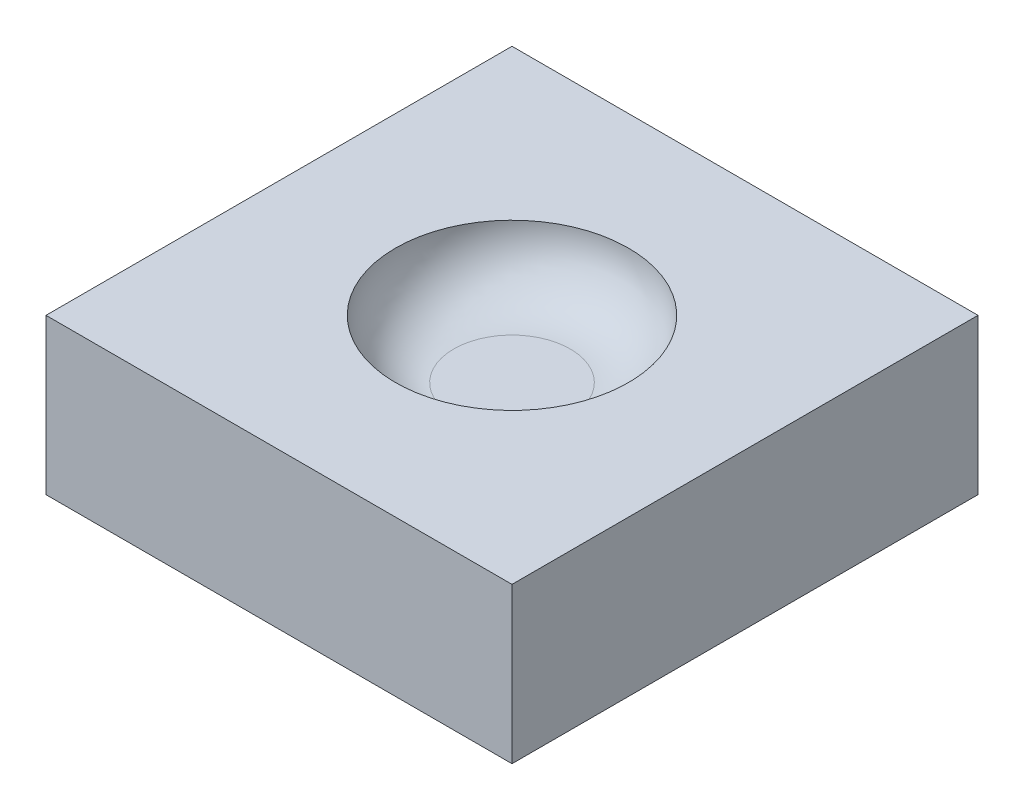
ISO-10303-21;
HEADER;
FILE_DESCRIPTION(('STEP AP214'),'2;1');
FILE_NAME('part.step','',(''),(''),'','','');
FILE_SCHEMA(('AUTOMOTIVE_DESIGN { 1 0 10303 214 1 1 1 1 }'));
ENDSEC;
DATA;
#1=APPLICATION_CONTEXT('core data for automotive mechanical design processes');
#2=APPLICATION_PROTOCOL_DEFINITION('international standard','automotive_design',2000,#1);
#3=PRODUCT_CONTEXT('',#1,'mechanical');
#4=PRODUCT('Part','Part','',(#3));
#5=PRODUCT_RELATED_PRODUCT_CATEGORY('part','',(#4));
#6=PRODUCT_DEFINITION_FORMATION('','',#4);
#7=PRODUCT_DEFINITION_CONTEXT('part definition',#1,'design');
#8=PRODUCT_DEFINITION('design','',#6,#7);
#9=PRODUCT_DEFINITION_SHAPE('','',#8);
#10=(LENGTH_UNIT() NAMED_UNIT(*) SI_UNIT(.MILLI.,.METRE.));
#11=(NAMED_UNIT(*) PLANE_ANGLE_UNIT() SI_UNIT($,.RADIAN.));
#12=(NAMED_UNIT(*) SI_UNIT($,.STERADIAN.) SOLID_ANGLE_UNIT());
#13=UNCERTAINTY_MEASURE_WITH_UNIT(LENGTH_MEASURE(1.E-05),#10,'distance_accuracy_value','');
#14=(GEOMETRIC_REPRESENTATION_CONTEXT(3) GLOBAL_UNCERTAINTY_ASSIGNED_CONTEXT((#13)) GLOBAL_UNIT_ASSIGNED_CONTEXT((#10,
#11,#12)) REPRESENTATION_CONTEXT('',''));
#15=CARTESIAN_POINT('',(0.,0.,0.));
#16=DIRECTION('',(0.,0.,1.));
#17=DIRECTION('',(1.,0.,0.));
#18=AXIS2_PLACEMENT_3D('',#15,#16,#17);
#19=CARTESIAN_POINT('',(76.2,50.8,76.2));
#20=DIRECTION('',(-1.,0.,0.));
#21=DIRECTION('',(0.,0.,1.));
#22=AXIS2_PLACEMENT_3D('',#19,#20,#21);
#23=PLANE('',#22);
#24=DIRECTION('',(0.,0.,-1.));
#25=VECTOR('',#24,1.);
#26=CARTESIAN_POINT('',(76.2,0.,76.2));
#27=LINE('',#26,#25);
#28=CARTESIAN_POINT('',(76.2,0.,76.2));
#29=VERTEX_POINT('',#28);
#30=CARTESIAN_POINT('',(76.2,0.,-76.2));
#31=VERTEX_POINT('',#30);
#32=EDGE_CURVE('E111',#29,#31,#27,.T.);
#33=ORIENTED_EDGE('',*,*,#32,.T.);
#34=DIRECTION('',(0.,-1.,0.));
#35=VECTOR('',#34,1.);
#36=CARTESIAN_POINT('',(76.2,50.8,-76.2));
#37=LINE('',#36,#35);
#38=CARTESIAN_POINT('',(76.2,50.8,-76.2));
#39=VERTEX_POINT('',#38);
#40=EDGE_CURVE('E11',#39,#31,#37,.T.);
#41=ORIENTED_EDGE('',*,*,#40,.F.);
#42=DIRECTION('',(0.,0.,-1.));
#43=VECTOR('',#42,1.);
#44=CARTESIAN_POINT('',(76.2,50.8,76.2));
#45=LINE('',#44,#43);
#46=CARTESIAN_POINT('',(76.2,50.8,76.2));
#47=VERTEX_POINT('',#46);
#48=EDGE_CURVE('E95',#47,#39,#45,.T.);
#49=ORIENTED_EDGE('',*,*,#48,.F.);
#50=DIRECTION('',(0.,-1.,0.));
#51=VECTOR('',#50,1.);
#52=CARTESIAN_POINT('',(76.2,50.8,76.2));
#53=LINE('',#52,#51);
#54=EDGE_CURVE('E107',#47,#29,#53,.T.);
#55=ORIENTED_EDGE('',*,*,#54,.T.);
#56=EDGE_LOOP('',(#33,#41,#49,#55));
#57=FACE_BOUND('',#56,.T.);
#58=ADVANCED_FACE('F43',(#57),#23,.F.);
#59=CARTESIAN_POINT('',(-76.2,50.8,-76.2));
#60=DIRECTION('',(0.,0.,1.));
#61=DIRECTION('',(1.,0.,0.));
#62=AXIS2_PLACEMENT_3D('',#59,#60,#61);
#63=PLANE('',#62);
#64=DIRECTION('',(-1.,0.,0.));
#65=VECTOR('',#64,1.);
#66=CARTESIAN_POINT('',(-76.2,0.,-76.2));
#67=LINE('',#66,#65);
#68=CARTESIAN_POINT('',(-76.2,0.,-76.2));
#69=VERTEX_POINT('',#68);
#70=EDGE_CURVE('E100',#31,#69,#67,.T.);
#71=ORIENTED_EDGE('',*,*,#70,.T.);
#72=DIRECTION('',(0.,-1.,0.));
#73=VECTOR('',#72,1.);
#74=CARTESIAN_POINT('',(-76.2,50.8,-76.2));
#75=LINE('',#74,#73);
#76=CARTESIAN_POINT('',(-76.2,50.8,-76.2));
#77=VERTEX_POINT('',#76);
#78=EDGE_CURVE('E52',#77,#69,#75,.T.);
#79=ORIENTED_EDGE('',*,*,#78,.F.);
#80=DIRECTION('',(-1.,0.,0.));
#81=VECTOR('',#80,1.);
#82=CARTESIAN_POINT('',(-76.2,50.8,-76.2));
#83=LINE('',#82,#81);
#84=EDGE_CURVE('E90',#39,#77,#83,.T.);
#85=ORIENTED_EDGE('',*,*,#84,.F.);
#86=ORIENTED_EDGE('',*,*,#40,.T.);
#87=EDGE_LOOP('',(#71,#79,#85,#86));
#88=FACE_BOUND('',#87,.T.);
#89=ADVANCED_FACE('F99',(#88),#63,.F.);
#90=CARTESIAN_POINT('',(-76.2,50.8,76.2));
#91=DIRECTION('',(1.,0.,0.));
#92=DIRECTION('',(0.,0.,-1.));
#93=AXIS2_PLACEMENT_3D('',#90,#91,#92);
#94=PLANE('',#93);
#95=DIRECTION('',(0.,0.,1.));
#96=VECTOR('',#95,1.);
#97=CARTESIAN_POINT('',(-76.2,0.,76.2));
#98=LINE('',#97,#96);
#99=CARTESIAN_POINT('',(-76.2,0.,76.2));
#100=VERTEX_POINT('',#99);
#101=EDGE_CURVE('E77',#69,#100,#98,.T.);
#102=ORIENTED_EDGE('',*,*,#101,.T.);
#103=DIRECTION('',(0.,-1.,0.));
#104=VECTOR('',#103,1.);
#105=CARTESIAN_POINT('',(-76.2,50.8,76.2));
#106=LINE('',#105,#104);
#107=CARTESIAN_POINT('',(-76.2,50.8,76.2));
#108=VERTEX_POINT('',#107);
#109=EDGE_CURVE('E102',#108,#100,#106,.T.);
#110=ORIENTED_EDGE('',*,*,#109,.F.);
#111=DIRECTION('',(0.,0.,1.));
#112=VECTOR('',#111,1.);
#113=CARTESIAN_POINT('',(-76.2,50.8,76.2));
#114=LINE('',#113,#112);
#115=EDGE_CURVE('E93',#77,#108,#114,.T.);
#116=ORIENTED_EDGE('',*,*,#115,.F.);
#117=ORIENTED_EDGE('',*,*,#78,.T.);
#118=EDGE_LOOP('',(#102,#110,#116,#117));
#119=FACE_BOUND('',#118,.T.);
#120=ADVANCED_FACE('F103',(#119),#94,.F.);
#121=CARTESIAN_POINT('',(-76.2,50.8,76.2));
#122=DIRECTION('',(0.,0.,-1.));
#123=DIRECTION('',(-1.,0.,0.));
#124=AXIS2_PLACEMENT_3D('',#121,#122,#123);
#125=PLANE('',#124);
#126=DIRECTION('',(1.,0.,0.));
#127=VECTOR('',#126,1.);
#128=CARTESIAN_POINT('',(-76.2,0.,76.2));
#129=LINE('',#128,#127);
#130=EDGE_CURVE('E83',#100,#29,#129,.T.);
#131=ORIENTED_EDGE('',*,*,#130,.T.);
#132=ORIENTED_EDGE('',*,*,#54,.F.);
#133=DIRECTION('',(1.,0.,0.));
#134=VECTOR('',#133,1.);
#135=CARTESIAN_POINT('',(-76.2,50.8,76.2));
#136=LINE('',#135,#134);
#137=EDGE_CURVE('E60',#108,#47,#136,.T.);
#138=ORIENTED_EDGE('',*,*,#137,.F.);
#139=ORIENTED_EDGE('',*,*,#109,.T.);
#140=EDGE_LOOP('',(#131,#132,#138,#139));
#141=FACE_BOUND('',#140,.T.);
#142=ADVANCED_FACE('F125',(#141),#125,.F.);
#143=CARTESIAN_POINT('',(0.,50.8,0.));
#144=DIRECTION('',(0.,-1.,0.));
#145=DIRECTION('',(0.,0.,-1.));
#146=AXIS2_PLACEMENT_3D('',#143,#144,#145);
#147=PLANE('',#146);
#148=CARTESIAN_POINT('',(0.,50.8,0.));
#149=DIRECTION('',(0.,1.,0.));
#150=DIRECTION('',(-1.,0.,0.));
#151=AXIS2_PLACEMENT_3D('',#148,#149,#150);
#152=CIRCLE('',#151,38.1);
#153=CARTESIAN_POINT('',(-38.1,50.8,0.));
#154=VERTEX_POINT('',#153);
#155=EDGE_CURVE('E115',#154,#154,#152,.T.);
#156=ORIENTED_EDGE('',*,*,#155,.F.);
#157=EDGE_LOOP('',(#156));
#158=FACE_BOUND('',#157,.T.);
#159=ORIENTED_EDGE('',*,*,#48,.T.);
#160=ORIENTED_EDGE('',*,*,#84,.T.);
#161=ORIENTED_EDGE('',*,*,#115,.T.);
#162=ORIENTED_EDGE('',*,*,#137,.T.);
#163=EDGE_LOOP('',(#159,#160,#161,#162));
#164=FACE_BOUND('',#163,.T.);
#165=ADVANCED_FACE('F91',(#158,#164),#147,.F.);
#166=CARTESIAN_POINT('',(0.,0.,0.));
#167=DIRECTION('',(0.,-1.,0.));
#168=DIRECTION('',(0.,0.,-1.));
#169=AXIS2_PLACEMENT_3D('',#166,#167,#168);
#170=PLANE('',#169);
#171=ORIENTED_EDGE('',*,*,#32,.F.);
#172=ORIENTED_EDGE('',*,*,#130,.F.);
#173=ORIENTED_EDGE('',*,*,#101,.F.);
#174=ORIENTED_EDGE('',*,*,#70,.F.);
#175=EDGE_LOOP('',(#171,#172,#173,#174));
#176=FACE_BOUND('',#175,.T.);
#177=ADVANCED_FACE('F128',(#176),#170,.T.);
#178=CARTESIAN_POINT('',(0.,50.8,0.));
#179=DIRECTION('',(0.,1.,0.));
#180=DIRECTION('',(-1.,0.,0.));
#181=AXIS2_PLACEMENT_3D('',#178,#179,#180);
#182=TOROIDAL_SURFACE('',#181,19.05,19.05);
#183=CARTESIAN_POINT('',(0.,31.75,0.));
#184=DIRECTION('',(0.,1.,0.));
#185=DIRECTION('',(-1.,0.,0.));
#186=AXIS2_PLACEMENT_3D('',#183,#184,#185);
#187=CIRCLE('',#186,19.05);
#188=CARTESIAN_POINT('',(-19.05,31.75,0.));
#189=VERTEX_POINT('',#188);
#190=EDGE_CURVE('E135',#189,#189,#187,.T.);
#191=ORIENTED_EDGE('',*,*,#190,.F.);
#192=EDGE_LOOP('',(#191));
#193=FACE_BOUND('',#192,.T.);
#194=ORIENTED_EDGE('',*,*,#155,.T.);
#195=EDGE_LOOP('',(#194));
#196=FACE_BOUND('',#195,.T.);
#197=ADVANCED_FACE('F142',(#193,#196),#182,.F.);
#198=CARTESIAN_POINT('',(-19.05,31.75,0.));
#199=DIRECTION('',(0.,-1.,0.));
#200=DIRECTION('',(1.,0.,0.));
#201=AXIS2_PLACEMENT_3D('',#198,#199,#200);
#202=PLANE('',#201);
#203=ORIENTED_EDGE('',*,*,#190,.T.);
#204=EDGE_LOOP('',(#203));
#205=FACE_BOUND('',#204,.T.);
#206=ADVANCED_FACE('F140',(#205),#202,.F.);
#207=CLOSED_SHELL('',(#58,#89,#120,#142,#165,#177,#197,#206));
#208=MANIFOLD_SOLID_BREP('B2',#207);
#209=ADVANCED_BREP_SHAPE_REPRESENTATION('',(#18,#208),#14);
#210=SHAPE_DEFINITION_REPRESENTATION(#9,#209);
ENDSEC;
END-ISO-10303-21;
